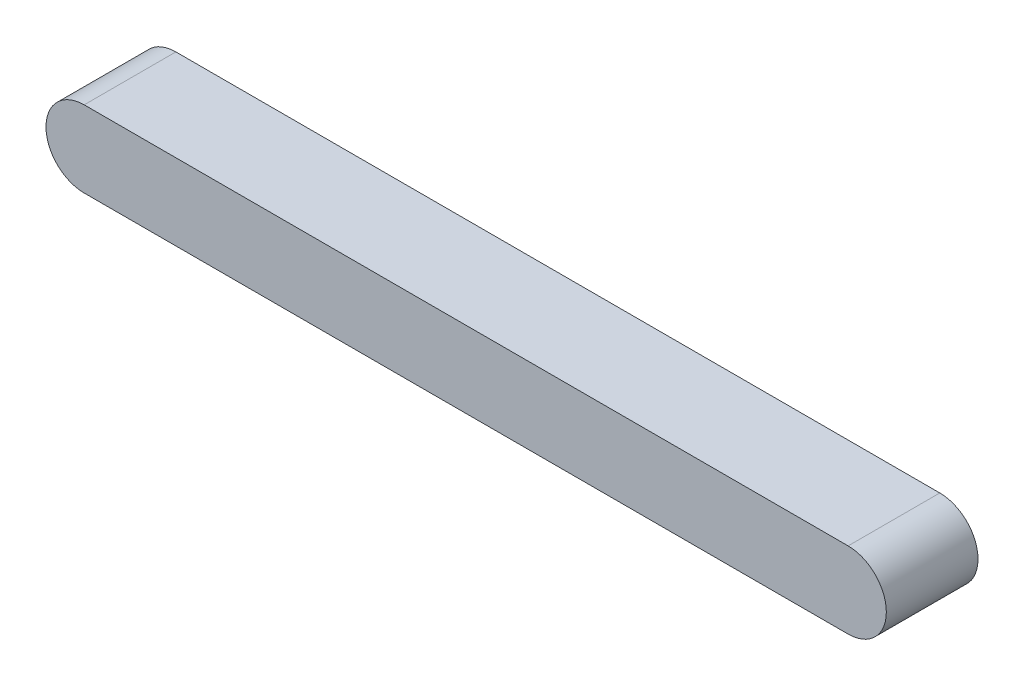
ISO-10303-21;
HEADER;
FILE_DESCRIPTION(('STEP AP214'),'2;1');
FILE_NAME('part.step','',(''),(''),'','','');
FILE_SCHEMA(('AUTOMOTIVE_DESIGN { 1 0 10303 214 1 1 1 1 }'));
ENDSEC;
DATA;
#1=APPLICATION_CONTEXT('core data for automotive mechanical design processes');
#2=APPLICATION_PROTOCOL_DEFINITION('international standard','automotive_design',2000,#1);
#3=PRODUCT_CONTEXT('',#1,'mechanical');
#4=PRODUCT('Part','Part','',(#3));
#5=PRODUCT_RELATED_PRODUCT_CATEGORY('part','',(#4));
#6=PRODUCT_DEFINITION_FORMATION('','',#4);
#7=PRODUCT_DEFINITION_CONTEXT('part definition',#1,'design');
#8=PRODUCT_DEFINITION('design','',#6,#7);
#9=PRODUCT_DEFINITION_SHAPE('','',#8);
#10=(LENGTH_UNIT() NAMED_UNIT(*) SI_UNIT(.MILLI.,.METRE.));
#11=(NAMED_UNIT(*) PLANE_ANGLE_UNIT() SI_UNIT($,.RADIAN.));
#12=(NAMED_UNIT(*) SI_UNIT($,.STERADIAN.) SOLID_ANGLE_UNIT());
#13=UNCERTAINTY_MEASURE_WITH_UNIT(LENGTH_MEASURE(1.E-05),#10,'distance_accuracy_value','');
#14=(GEOMETRIC_REPRESENTATION_CONTEXT(3) GLOBAL_UNCERTAINTY_ASSIGNED_CONTEXT((#13)) GLOBAL_UNIT_ASSIGNED_CONTEXT((#10,
#11,#12)) REPRESENTATION_CONTEXT('',''));
#15=CARTESIAN_POINT('',(0.,0.,0.));
#16=DIRECTION('',(0.,0.,1.));
#17=DIRECTION('',(1.,0.,0.));
#18=AXIS2_PLACEMENT_3D('',#15,#16,#17);
#19=CARTESIAN_POINT('',(-50.,0.,12.));
#20=DIRECTION('',(0.,0.,-1.));
#21=DIRECTION('',(-1.,0.,0.));
#22=AXIS2_PLACEMENT_3D('',#19,#20,#21);
#23=CYLINDRICAL_SURFACE('',#22,5.);
#24=CARTESIAN_POINT('',(-50.,0.,0.));
#25=DIRECTION('',(0.,0.,1.));
#26=DIRECTION('',(1.,0.,0.));
#27=AXIS2_PLACEMENT_3D('',#24,#25,#26);
#28=CIRCLE('',#27,5.);
#29=CARTESIAN_POINT('',(-50.,4.99999999999998,0.));
#30=VERTEX_POINT('',#29);
#31=CARTESIAN_POINT('',(-50.,-5.00000000000001,0.));
#32=VERTEX_POINT('',#31);
#33=EDGE_CURVE('E97',#30,#32,#28,.T.);
#34=ORIENTED_EDGE('',*,*,#33,.T.);
#35=DIRECTION('',(0.,0.,-1.));
#36=VECTOR('',#35,1.);
#37=CARTESIAN_POINT('',(-50.,-5.00000000000001,12.));
#38=LINE('',#37,#36);
#39=CARTESIAN_POINT('',(-50.,-5.00000000000001,12.));
#40=VERTEX_POINT('',#39);
#41=EDGE_CURVE('E11',#40,#32,#38,.T.);
#42=ORIENTED_EDGE('',*,*,#41,.F.);
#43=CARTESIAN_POINT('',(-50.,0.,12.));
#44=DIRECTION('',(0.,0.,1.));
#45=DIRECTION('',(1.,0.,0.));
#46=AXIS2_PLACEMENT_3D('',#43,#44,#45);
#47=CIRCLE('',#46,5.);
#48=CARTESIAN_POINT('',(-50.,4.99999999999998,12.));
#49=VERTEX_POINT('',#48);
#50=EDGE_CURVE('E85',#49,#40,#47,.T.);
#51=ORIENTED_EDGE('',*,*,#50,.F.);
#52=DIRECTION('',(0.,0.,-1.));
#53=VECTOR('',#52,1.);
#54=CARTESIAN_POINT('',(-50.,4.99999999999998,12.));
#55=LINE('',#54,#53);
#56=EDGE_CURVE('E93',#49,#30,#55,.T.);
#57=ORIENTED_EDGE('',*,*,#56,.T.);
#58=EDGE_LOOP('',(#34,#42,#51,#57));
#59=FACE_BOUND('',#58,.T.);
#60=ADVANCED_FACE('F34',(#59),#23,.T.);
#61=CARTESIAN_POINT('',(-50.,-5.00000000000001,12.));
#62=DIRECTION('',(0.,1.,0.));
#63=DIRECTION('',(-1.,0.,0.));
#64=AXIS2_PLACEMENT_3D('',#61,#62,#63);
#65=PLANE('',#64);
#66=DIRECTION('',(1.,0.,0.));
#67=VECTOR('',#66,1.);
#68=CARTESIAN_POINT('',(-50.,-5.00000000000001,0.));
#69=LINE('',#68,#67);
#70=CARTESIAN_POINT('',(50.,-4.99999999999998,0.));
#71=VERTEX_POINT('',#70);
#72=EDGE_CURVE('E89',#32,#71,#69,.T.);
#73=ORIENTED_EDGE('',*,*,#72,.T.);
#74=DIRECTION('',(0.,0.,-1.));
#75=VECTOR('',#74,1.);
#76=CARTESIAN_POINT('',(50.,-4.99999999999998,12.));
#77=LINE('',#76,#75);
#78=CARTESIAN_POINT('',(50.,-4.99999999999998,12.));
#79=VERTEX_POINT('',#78);
#80=EDGE_CURVE('E42',#79,#71,#77,.T.);
#81=ORIENTED_EDGE('',*,*,#80,.F.);
#82=DIRECTION('',(1.,0.,0.));
#83=VECTOR('',#82,1.);
#84=CARTESIAN_POINT('',(-50.,-5.00000000000001,12.));
#85=LINE('',#84,#83);
#86=EDGE_CURVE('E80',#40,#79,#85,.T.);
#87=ORIENTED_EDGE('',*,*,#86,.F.);
#88=ORIENTED_EDGE('',*,*,#41,.T.);
#89=EDGE_LOOP('',(#73,#81,#87,#88));
#90=FACE_BOUND('',#89,.T.);
#91=ADVANCED_FACE('F88',(#90),#65,.F.);
#92=CARTESIAN_POINT('',(50.,0.,12.));
#93=DIRECTION('',(0.,0.,-1.));
#94=DIRECTION('',(-1.,0.,0.));
#95=AXIS2_PLACEMENT_3D('',#92,#93,#94);
#96=CYLINDRICAL_SURFACE('',#95,5.);
#97=CARTESIAN_POINT('',(50.,0.,0.));
#98=DIRECTION('',(0.,0.,1.));
#99=DIRECTION('',(1.,0.,0.));
#100=AXIS2_PLACEMENT_3D('',#97,#98,#99);
#101=CIRCLE('',#100,5.);
#102=CARTESIAN_POINT('',(50.,5.00000000000001,0.));
#103=VERTEX_POINT('',#102);
#104=EDGE_CURVE('E67',#71,#103,#101,.T.);
#105=ORIENTED_EDGE('',*,*,#104,.T.);
#106=DIRECTION('',(0.,0.,-1.));
#107=VECTOR('',#106,1.);
#108=CARTESIAN_POINT('',(50.,5.00000000000001,12.));
#109=LINE('',#108,#107);
#110=CARTESIAN_POINT('',(50.,5.00000000000001,12.));
#111=VERTEX_POINT('',#110);
#112=EDGE_CURVE('E90',#111,#103,#109,.T.);
#113=ORIENTED_EDGE('',*,*,#112,.F.);
#114=CARTESIAN_POINT('',(50.,0.,12.));
#115=DIRECTION('',(0.,0.,1.));
#116=DIRECTION('',(1.,0.,0.));
#117=AXIS2_PLACEMENT_3D('',#114,#115,#116);
#118=CIRCLE('',#117,5.);
#119=EDGE_CURVE('E83',#79,#111,#118,.T.);
#120=ORIENTED_EDGE('',*,*,#119,.F.);
#121=ORIENTED_EDGE('',*,*,#80,.T.);
#122=EDGE_LOOP('',(#105,#113,#120,#121));
#123=FACE_BOUND('',#122,.T.);
#124=ADVANCED_FACE('F91',(#123),#96,.T.);
#125=CARTESIAN_POINT('',(-50.,4.99999999999998,12.));
#126=DIRECTION('',(0.,-1.,0.));
#127=DIRECTION('',(1.,0.,0.));
#128=AXIS2_PLACEMENT_3D('',#125,#126,#127);
#129=PLANE('',#128);
#130=DIRECTION('',(-1.,0.,0.));
#131=VECTOR('',#130,1.);
#132=CARTESIAN_POINT('',(-50.,4.99999999999998,0.));
#133=LINE('',#132,#131);
#134=EDGE_CURVE('E73',#103,#30,#133,.T.);
#135=ORIENTED_EDGE('',*,*,#134,.T.);
#136=ORIENTED_EDGE('',*,*,#56,.F.);
#137=DIRECTION('',(-1.,0.,0.));
#138=VECTOR('',#137,1.);
#139=CARTESIAN_POINT('',(-50.,4.99999999999998,12.));
#140=LINE('',#139,#138);
#141=EDGE_CURVE('E50',#111,#49,#140,.T.);
#142=ORIENTED_EDGE('',*,*,#141,.F.);
#143=ORIENTED_EDGE('',*,*,#112,.T.);
#144=EDGE_LOOP('',(#135,#136,#142,#143));
#145=FACE_BOUND('',#144,.T.);
#146=ADVANCED_FACE('F104',(#145),#129,.F.);
#147=CARTESIAN_POINT('',(-50.,0.,12.));
#148=DIRECTION('',(0.,0.,1.));
#149=DIRECTION('',(1.,0.,0.));
#150=AXIS2_PLACEMENT_3D('',#147,#148,#149);
#151=PLANE('',#150);
#152=ORIENTED_EDGE('',*,*,#50,.T.);
#153=ORIENTED_EDGE('',*,*,#86,.T.);
#154=ORIENTED_EDGE('',*,*,#119,.T.);
#155=ORIENTED_EDGE('',*,*,#141,.T.);
#156=EDGE_LOOP('',(#152,#153,#154,#155));
#157=FACE_BOUND('',#156,.T.);
#158=ADVANCED_FACE('F81',(#157),#151,.T.);
#159=CARTESIAN_POINT('',(-50.,0.,0.));
#160=DIRECTION('',(0.,0.,1.));
#161=DIRECTION('',(1.,0.,0.));
#162=AXIS2_PLACEMENT_3D('',#159,#160,#161);
#163=PLANE('',#162);
#164=ORIENTED_EDGE('',*,*,#33,.F.);
#165=ORIENTED_EDGE('',*,*,#134,.F.);
#166=ORIENTED_EDGE('',*,*,#104,.F.);
#167=ORIENTED_EDGE('',*,*,#72,.F.);
#168=EDGE_LOOP('',(#164,#165,#166,#167));
#169=FACE_BOUND('',#168,.T.);
#170=ADVANCED_FACE('F107',(#169),#163,.F.);
#171=CLOSED_SHELL('',(#60,#91,#124,#146,#158,#170));
#172=MANIFOLD_SOLID_BREP('B2',#171);
#173=ADVANCED_BREP_SHAPE_REPRESENTATION('',(#18,#172),#14);
#174=SHAPE_DEFINITION_REPRESENTATION(#9,#173);
ENDSEC;
END-ISO-10303-21;
